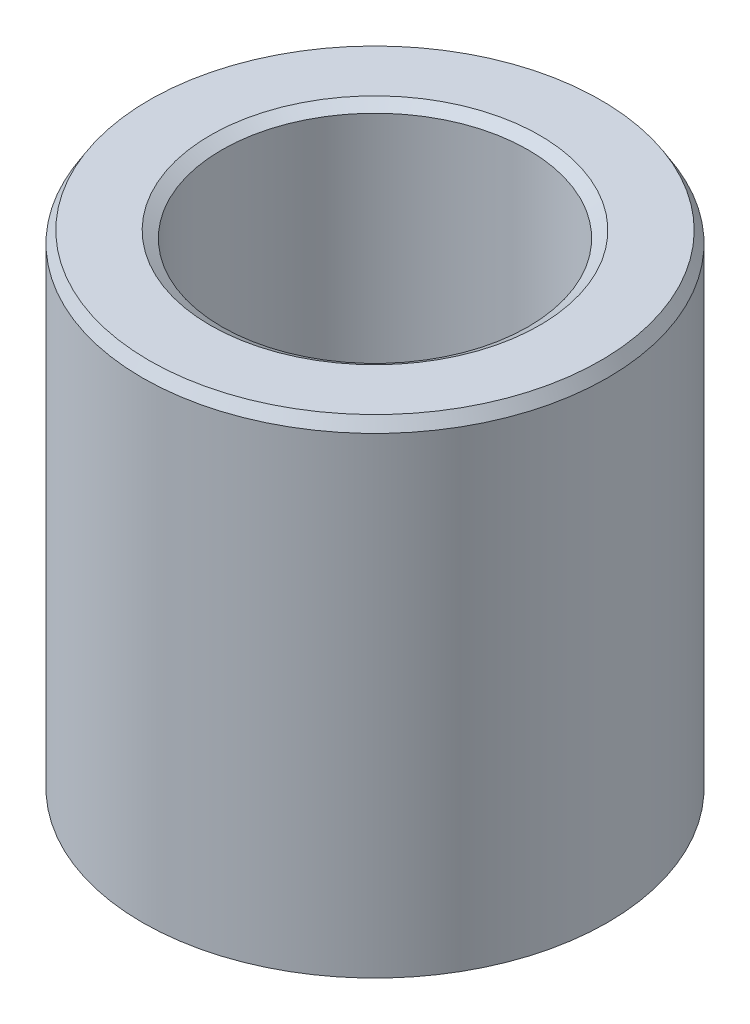
ISO-10303-21;
HEADER;
FILE_DESCRIPTION(('STEP AP214'),'2;1');
FILE_NAME('part.step','',(''),(''),'','','');
FILE_SCHEMA(('AUTOMOTIVE_DESIGN { 1 0 10303 214 1 1 1 1 }'));
ENDSEC;
DATA;
#1=APPLICATION_CONTEXT('core data for automotive mechanical design processes');
#2=APPLICATION_PROTOCOL_DEFINITION('international standard','automotive_design',2000,#1);
#3=PRODUCT_CONTEXT('',#1,'mechanical');
#4=PRODUCT('Part','Part','',(#3));
#5=PRODUCT_RELATED_PRODUCT_CATEGORY('part','',(#4));
#6=PRODUCT_DEFINITION_FORMATION('','',#4);
#7=PRODUCT_DEFINITION_CONTEXT('part definition',#1,'design');
#8=PRODUCT_DEFINITION('design','',#6,#7);
#9=PRODUCT_DEFINITION_SHAPE('','',#8);
#10=(LENGTH_UNIT() NAMED_UNIT(*) SI_UNIT(.MILLI.,.METRE.));
#11=(NAMED_UNIT(*) PLANE_ANGLE_UNIT() SI_UNIT($,.RADIAN.));
#12=(NAMED_UNIT(*) SI_UNIT($,.STERADIAN.) SOLID_ANGLE_UNIT());
#13=UNCERTAINTY_MEASURE_WITH_UNIT(LENGTH_MEASURE(1.E-05),#10,'distance_accuracy_value','');
#14=(GEOMETRIC_REPRESENTATION_CONTEXT(3) GLOBAL_UNCERTAINTY_ASSIGNED_CONTEXT((#13)) GLOBAL_UNIT_ASSIGNED_CONTEXT((#10,
#11,#12)) REPRESENTATION_CONTEXT('',''));
#15=CARTESIAN_POINT('',(0.,0.,0.));
#16=DIRECTION('',(0.,0.,1.));
#17=DIRECTION('',(1.,0.,0.));
#18=AXIS2_PLACEMENT_3D('',#15,#16,#17);
#19=CARTESIAN_POINT('',(0.,105.320446026854,0.));
#20=DIRECTION('',(0.,-1.,0.));
#21=DIRECTION('',(0.,0.,-1.));
#22=AXIS2_PLACEMENT_3D('',#19,#20,#21);
#23=CYLINDRICAL_SURFACE('',#22,50.);
#24=CARTESIAN_POINT('',(0.,1.49423927685612,0.));
#25=DIRECTION('',(0.,1.,0.));
#26=DIRECTION('',(0.,0.,1.));
#27=AXIS2_PLACEMENT_3D('',#24,#25,#26);
#28=CIRCLE('',#27,50.);
#29=CARTESIAN_POINT('',(0.,1.49423927685612,50.));
#30=VERTEX_POINT('',#29);
#31=EDGE_CURVE('E10',#30,#30,#28,.T.);
#32=ORIENTED_EDGE('',*,*,#31,.T.);
#33=EDGE_LOOP('',(#32));
#34=FACE_BOUND('',#33,.T.);
#35=CARTESIAN_POINT('',(0.,102.863814809274,0.));
#36=DIRECTION('',(0.,1.,0.));
#37=DIRECTION('',(0.,0.,1.));
#38=AXIS2_PLACEMENT_3D('',#35,#36,#37);
#39=CIRCLE('',#38,50.);
#40=CARTESIAN_POINT('',(0.,102.863814809274,50.));
#41=VERTEX_POINT('',#40);
#42=EDGE_CURVE('E50',#41,#41,#39,.F.);
#43=ORIENTED_EDGE('',*,*,#42,.T.);
#44=EDGE_LOOP('',(#43));
#45=FACE_BOUND('',#44,.T.);
#46=ADVANCED_FACE('F39',(#34,#45),#23,.T.);
#47=CARTESIAN_POINT('',(0.,105.320446026854,0.));
#48=DIRECTION('',(0.,1.,0.));
#49=DIRECTION('',(0.,0.,1.));
#50=AXIS2_PLACEMENT_3D('',#47,#48,#49);
#51=PLANE('',#50);
#52=CARTESIAN_POINT('',(0.,105.320446026854,0.));
#53=DIRECTION('',(0.,1.,0.));
#54=DIRECTION('',(0.,0.,1.));
#55=AXIS2_PLACEMENT_3D('',#52,#53,#54);
#56=CIRCLE('',#55,35.3859058274195);
#57=CARTESIAN_POINT('',(0.,105.320446026854,35.3859058274195));
#58=VERTEX_POINT('',#57);
#59=EDGE_CURVE('E58',#58,#58,#56,.F.);
#60=ORIENTED_EDGE('',*,*,#59,.T.);
#61=EDGE_LOOP('',(#60));
#62=FACE_BOUND('',#61,.T.);
#63=CARTESIAN_POINT('',(0.,105.320446026854,0.));
#64=DIRECTION('',(0.,1.,0.));
#65=DIRECTION('',(0.,0.,1.));
#66=AXIS2_PLACEMENT_3D('',#63,#64,#65);
#67=CIRCLE('',#66,48.5057607231439);
#68=CARTESIAN_POINT('',(0.,105.320446026854,48.5057607231439));
#69=VERTEX_POINT('',#68);
#70=EDGE_CURVE('E61',#69,#69,#67,.T.);
#71=ORIENTED_EDGE('',*,*,#70,.T.);
#72=EDGE_LOOP('',(#71));
#73=FACE_BOUND('',#72,.T.);
#74=ADVANCED_FACE('F88',(#62,#73),#51,.T.);
#75=CARTESIAN_POINT('',(0.,0.,0.));
#76=DIRECTION('',(0.,1.,0.));
#77=DIRECTION('',(0.,0.,1.));
#78=AXIS2_PLACEMENT_3D('',#75,#76,#77);
#79=PLANE('',#78);
#80=CARTESIAN_POINT('',(0.,0.,0.));
#81=DIRECTION('',(0.,1.,0.));
#82=DIRECTION('',(0.,0.,1.));
#83=AXIS2_PLACEMENT_3D('',#80,#81,#82);
#84=CIRCLE('',#83,34.4235138866951);
#85=CARTESIAN_POINT('',(0.,0.,-34.4235138866951));
#86=VERTEX_POINT('',#85);
#87=EDGE_CURVE('E51',#86,#86,#84,.T.);
#88=ORIENTED_EDGE('',*,*,#87,.T.);
#89=EDGE_LOOP('',(#88));
#90=FACE_BOUND('',#89,.T.);
#91=CARTESIAN_POINT('',(0.,0.,0.));
#92=DIRECTION('',(0.,1.,0.));
#93=DIRECTION('',(0.,0.,1.));
#94=AXIS2_PLACEMENT_3D('',#91,#92,#93);
#95=CIRCLE('',#94,47.5433687824195);
#96=CARTESIAN_POINT('',(0.,0.,47.5433687824195));
#97=VERTEX_POINT('',#96);
#98=EDGE_CURVE('E54',#97,#97,#95,.F.);
#99=ORIENTED_EDGE('',*,*,#98,.T.);
#100=EDGE_LOOP('',(#99));
#101=FACE_BOUND('',#100,.T.);
#102=ADVANCED_FACE('F83',(#90,#101),#79,.F.);
#103=CARTESIAN_POINT('',(0.,105.320446026854,0.));
#104=DIRECTION('',(0.,-1.,0.));
#105=DIRECTION('',(0.,0.,-1.));
#106=AXIS2_PLACEMENT_3D('',#103,#104,#105);
#107=CYLINDRICAL_SURFACE('',#106,32.929274609839);
#108=CARTESIAN_POINT('',(0.,103.826206749998,0.));
#109=DIRECTION('',(0.,1.,0.));
#110=DIRECTION('',(0.,0.,1.));
#111=AXIS2_PLACEMENT_3D('',#108,#109,#110);
#112=CIRCLE('',#111,32.929274609839);
#113=CARTESIAN_POINT('',(0.,103.826206749998,32.929274609839));
#114=VERTEX_POINT('',#113);
#115=EDGE_CURVE('E67',#114,#114,#112,.T.);
#116=ORIENTED_EDGE('',*,*,#115,.T.);
#117=EDGE_LOOP('',(#116));
#118=FACE_BOUND('',#117,.T.);
#119=CARTESIAN_POINT('',(0.,2.45663121758052,0.));
#120=DIRECTION('',(0.,1.,0.));
#121=DIRECTION('',(0.,0.,1.));
#122=AXIS2_PLACEMENT_3D('',#119,#120,#121);
#123=CIRCLE('',#122,32.929274609839);
#124=CARTESIAN_POINT('',(0.,2.45663121758052,-32.929274609839));
#125=VERTEX_POINT('',#124);
#126=EDGE_CURVE('E69',#125,#125,#123,.F.);
#127=ORIENTED_EDGE('',*,*,#126,.T.);
#128=EDGE_LOOP('',(#127));
#129=FACE_BOUND('',#128,.T.);
#130=ADVANCED_FACE('F71',(#118,#129),#107,.F.);
#131=CARTESIAN_POINT('',(0.,103.826206749998,0.));
#132=DIRECTION('',(0.,1.,0.));
#133=DIRECTION('',(0.,0.,1.));
#134=AXIS2_PLACEMENT_3D('',#131,#132,#133);
#135=CONICAL_SURFACE('',#134,32.929274609839,1.0243347019523);
#136=ORIENTED_EDGE('',*,*,#59,.F.);
#137=EDGE_LOOP('',(#136));
#138=FACE_BOUND('',#137,.T.);
#139=ORIENTED_EDGE('',*,*,#115,.F.);
#140=EDGE_LOOP('',(#139));
#141=FACE_BOUND('',#140,.T.);
#142=ADVANCED_FACE('F77',(#138,#141),#135,.F.);
#143=CARTESIAN_POINT('',(0.,0.,0.));
#144=DIRECTION('',(0.,-1.,0.));
#145=DIRECTION('',(0.,0.,-1.));
#146=AXIS2_PLACEMENT_3D('',#143,#144,#145);
#147=CONICAL_SURFACE('',#146,34.4235138866951,0.54646162484259);
#148=CARTESIAN_POINT('',(0.,2.45663121758052,-32.929274609839));
#149=CARTESIAN_POINT('',(0.,2.43104130906406,-32.9448396023063));
#150=CARTESIAN_POINT('',(0.,2.4054514005476,-32.9604045947735));
#151=CARTESIAN_POINT('',(0.,2.35427158351467,-32.991534579708));
#152=CARTESIAN_POINT('',(0.,2.3286816749982,-33.0070995721753));
#153=CARTESIAN_POINT('',(0.,2.27750185796528,-33.0382295571098));
#154=CARTESIAN_POINT('',(0.,2.25191194944881,-33.053794549577));
#155=CARTESIAN_POINT('',(0.,2.20073213241589,-33.0849245345115));
#156=CARTESIAN_POINT('',(0.,2.17514222389942,-33.1004895269788));
#157=CARTESIAN_POINT('',(0.,2.12396240686649,-33.1316195119133));
#158=CARTESIAN_POINT('',(0.,2.09837249835003,-33.1471845043805));
#159=CARTESIAN_POINT('',(0.,2.0471926813171,-33.178314489315));
#160=CARTESIAN_POINT('',(0.,2.02160277280064,-33.1938794817823));
#161=CARTESIAN_POINT('',(0.,1.97042295576771,-33.2250094667168));
#162=CARTESIAN_POINT('',(0.,1.94483304725125,-33.240574459184));
#163=CARTESIAN_POINT('',(0.,1.89365323021832,-33.2717044441185));
#164=CARTESIAN_POINT('',(0.,1.86806332170186,-33.2872694365858));
#165=CARTESIAN_POINT('',(0.,1.81688350466893,-33.3183994215203));
#166=CARTESIAN_POINT('',(0.,1.79129359615247,-33.3339644139875));
#167=CARTESIAN_POINT('',(0.,1.74011377911954,-33.365094398922));
#168=CARTESIAN_POINT('',(0.,1.71452387060307,-33.3806593913893));
#169=CARTESIAN_POINT('',(0.,1.66334405357015,-33.4117893763238));
#170=CARTESIAN_POINT('',(0.,1.63775414505368,-33.427354368791));
#171=CARTESIAN_POINT('',(0.,1.58657432802076,-33.4584843537255));
#172=CARTESIAN_POINT('',(0.,1.56098441950429,-33.4740493461928));
#173=CARTESIAN_POINT('',(0.,1.50980460247136,-33.5051793311273));
#174=CARTESIAN_POINT('',(0.,1.4842146939549,-33.5207443235945));
#175=CARTESIAN_POINT('',(0.,1.43303487692197,-33.551874308529));
#176=CARTESIAN_POINT('',(0.,1.40744496840551,-33.5674393009963));
#177=CARTESIAN_POINT('',(0.,1.35626515137258,-33.5985692859308));
#178=CARTESIAN_POINT('',(0.,1.33067524285612,-33.6141342783981));
#179=CARTESIAN_POINT('',(0.,1.27949542582319,-33.6452642633325));
#180=CARTESIAN_POINT('',(0.,1.25390551730673,-33.6608292557998));
#181=CARTESIAN_POINT('',(0.,1.2027257002738,-33.6919592407343));
#182=CARTESIAN_POINT('',(0.,1.17713579175733,-33.7075242332016));
#183=CARTESIAN_POINT('',(0.,1.12595597472441,-33.7386542181361));
#184=CARTESIAN_POINT('',(0.,1.10036606620794,-33.7542192106033));
#185=CARTESIAN_POINT('',(0.,1.04918624917502,-33.7853491955378));
#186=CARTESIAN_POINT('',(0.,1.02359634065855,-33.8009141880051));
#187=CARTESIAN_POINT('',(0.,0.972416523625623,-33.8320441729396));
#188=CARTESIAN_POINT('',(0.,0.946826615109161,-33.8476091654068));
#189=CARTESIAN_POINT('',(0.,0.895646798076233,-33.8787391503413));
#190=CARTESIAN_POINT('',(0.,0.870056889559768,-33.8943041428086));
#191=CARTESIAN_POINT('',(0.,0.818877072526841,-33.9254341277431));
#192=CARTESIAN_POINT('',(0.,0.793287164010378,-33.9409991202103));
#193=CARTESIAN_POINT('',(0.,0.74210734697745,-33.9721291051448));
#194=CARTESIAN_POINT('',(0.,0.716517438460985,-33.9876940976121));
#195=CARTESIAN_POINT('',(0.,0.665337621428058,-34.0188240825466));
#196=CARTESIAN_POINT('',(0.,0.639747712911595,-34.0343890750138));
#197=CARTESIAN_POINT('',(0.,0.588567895878668,-34.0655190599483));
#198=CARTESIAN_POINT('',(0.,0.562977987362203,-34.0810840524156));
#199=CARTESIAN_POINT('',(0.,0.511798170329275,-34.1122140373501));
#200=CARTESIAN_POINT('',(0.,0.486208261812812,-34.1277790298173));
#201=CARTESIAN_POINT('',(0.,0.435028444779885,-34.1589090147518));
#202=CARTESIAN_POINT('',(0.,0.40943853626342,-34.1744740072191));
#203=CARTESIAN_POINT('',(0.,0.358258719230492,-34.2056039921536));
#204=CARTESIAN_POINT('',(0.,0.33266881071403,-34.2211689846208));
#205=CARTESIAN_POINT('',(0.,0.281488993681102,-34.2522989695553));
#206=CARTESIAN_POINT('',(0.,0.255899085164637,-34.2678639620226));
#207=CARTESIAN_POINT('',(0.,0.20471926813171,-34.2989939469571));
#208=CARTESIAN_POINT('',(0.,0.179129359615247,-34.3145589394244));
#209=CARTESIAN_POINT('',(0.,0.12794954258232,-34.3456889243589));
#210=CARTESIAN_POINT('',(0.,0.102359634065855,-34.3612539168261));
#211=CARTESIAN_POINT('',(0.,0.0511798170329265,-34.3923839017606));
#212=CARTESIAN_POINT('',(0.,0.0255899085164621,-34.4079488942279));
#213=CARTESIAN_POINT('',(0.,0.,-34.4235138866951));
#214=B_SPLINE_CURVE_WITH_KNOTS('',3,(#148,#149,#150,#151,#152,#153,#154,#155,#156,#157,#158,
#159,#160,#161,#162,#163,#164,#165,#166,#167,#168,#169,#170,#171,#172,#173,#174,#175,#176,#177,
#178,#179,#180,#181,#182,#183,#184,#185,#186,#187,#188,#189,#190,#191,#192,#193,#194,#195,#196,
#197,#198,#199,#200,#201,#202,#203,#204,#205,#206,#207,#208,#209,#210,#211,#212,#213),
.UNSPECIFIED.,.F.,.F.,(4,2,2,2,2,2,2,2,2,2,2,2,2,2,2,2,2,2,2,2,2,2,2,2,2,2,2,2,2,2,2,2,4),(0.,
0.0898555044250459,0.179711008850088,0.269566513275134,0.359422017700176,0.449277522125222,
0.539133026550264,0.62898853097531,0.718844035400352,0.808699539825398,0.89855504425044,
0.988410548675486,1.07826605310053,1.16812155752557,1.25797706195062,1.34783256637566,
1.43768807080071,1.52754357522575,1.6173990796508,1.70725458407584,1.79711008850088,
1.88696559292593,1.97682109735097,2.06667660177602,2.15653210620106,2.2463876106261,
2.33624311505115,2.42609861947619,2.51595412390124,2.60580962832628,2.69566513275133,
2.78552063717637,2.87537614160141),.UNSPECIFIED.);
#215=EDGE_CURVE('BSEAM73',#125,#86,#214,.T.);
#216=ORIENTED_EDGE('',*,*,#126,.F.);
#217=ORIENTED_EDGE('',*,*,#87,.F.);
#218=ORIENTED_EDGE('',*,*,#215,.T.);
#219=ORIENTED_EDGE('',*,*,#215,.F.);
#220=EDGE_LOOP('',(#216,#218,#217,#219));
#221=FACE_BOUND('',#220,.T.);
#222=ADVANCED_FACE('F73',(#221),#147,.F.);
#223=CARTESIAN_POINT('',(0.,1.49423927685612,0.));
#224=DIRECTION('',(0.,1.,0.));
#225=DIRECTION('',(0.,0.,1.));
#226=AXIS2_PLACEMENT_3D('',#223,#224,#225);
#227=CONICAL_SURFACE('',#226,50.,1.0243347019523);
#228=ORIENTED_EDGE('',*,*,#98,.F.);
#229=EDGE_LOOP('',(#228));
#230=FACE_BOUND('',#229,.T.);
#231=ORIENTED_EDGE('',*,*,#31,.F.);
#232=EDGE_LOOP('',(#231));
#233=FACE_BOUND('',#232,.T.);
#234=ADVANCED_FACE('F76',(#230,#233),#227,.T.);
#235=CARTESIAN_POINT('',(0.,105.320446026854,0.));
#236=DIRECTION('',(0.,-1.,0.));
#237=DIRECTION('',(0.,0.,-1.));
#238=AXIS2_PLACEMENT_3D('',#235,#236,#237);
#239=CONICAL_SURFACE('',#238,48.5057607231439,0.546461624842595);
#240=ORIENTED_EDGE('',*,*,#42,.F.);
#241=EDGE_LOOP('',(#240));
#242=FACE_BOUND('',#241,.T.);
#243=ORIENTED_EDGE('',*,*,#70,.F.);
#244=EDGE_LOOP('',(#243));
#245=FACE_BOUND('',#244,.T.);
#246=ADVANCED_FACE('F45',(#242,#245),#239,.T.);
#247=CLOSED_SHELL('',(#46,#74,#102,#130,#142,#222,#234,#246));
#248=MANIFOLD_SOLID_BREP('B2',#247);
#249=ADVANCED_BREP_SHAPE_REPRESENTATION('',(#18,#248),#14);
#250=SHAPE_DEFINITION_REPRESENTATION(#9,#249);
ENDSEC;
END-ISO-10303-21;
